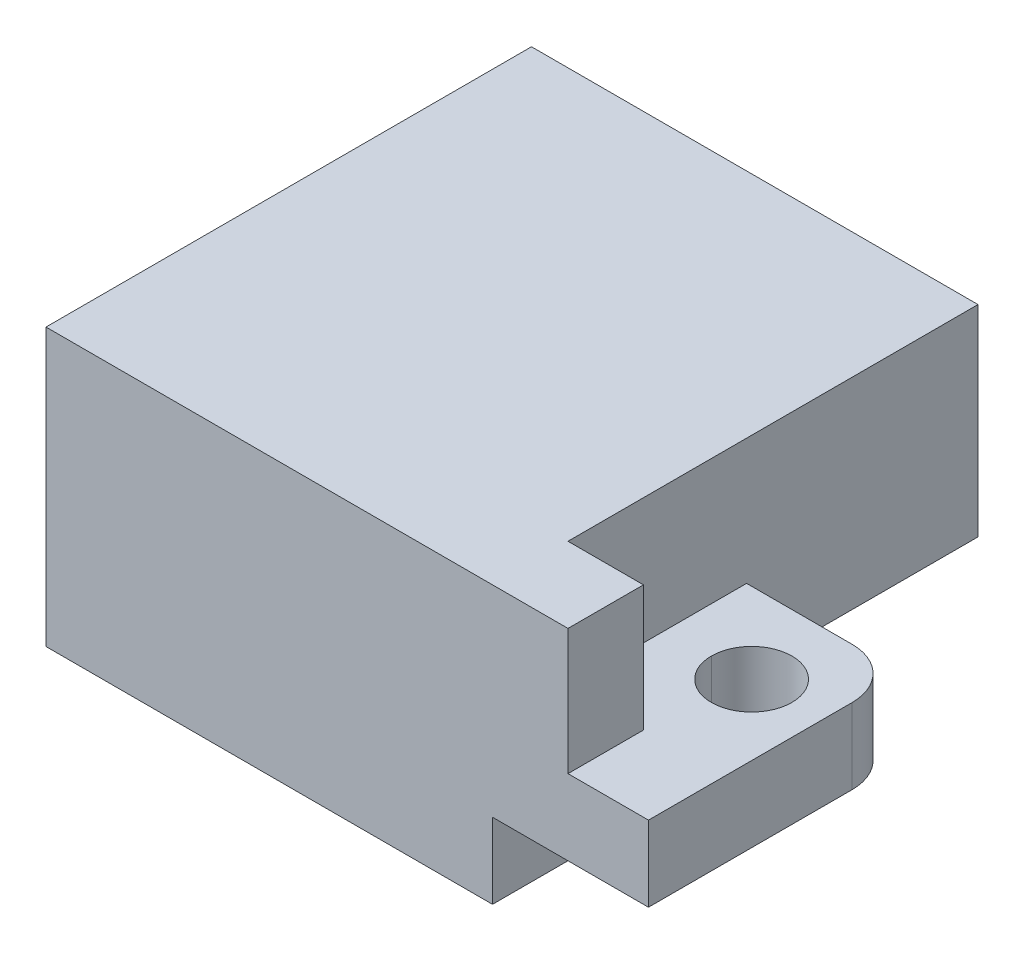
ISO-10303-21;
HEADER;
FILE_DESCRIPTION(('STEP AP214'),'2;1');
FILE_NAME('part.step','',(''),(''),'','','');
FILE_SCHEMA(('AUTOMOTIVE_DESIGN { 1 0 10303 214 1 1 1 1 }'));
ENDSEC;
DATA;
#1=APPLICATION_CONTEXT('core data for automotive mechanical design processes');
#2=APPLICATION_PROTOCOL_DEFINITION('international standard','automotive_design',2000,#1);
#3=PRODUCT_CONTEXT('',#1,'mechanical');
#4=PRODUCT('Part','Part','',(#3));
#5=PRODUCT_RELATED_PRODUCT_CATEGORY('part','',(#4));
#6=PRODUCT_DEFINITION_FORMATION('','',#4);
#7=PRODUCT_DEFINITION_CONTEXT('part definition',#1,'design');
#8=PRODUCT_DEFINITION('design','',#6,#7);
#9=PRODUCT_DEFINITION_SHAPE('','',#8);
#10=(LENGTH_UNIT() NAMED_UNIT(*) SI_UNIT(.MILLI.,.METRE.));
#11=(NAMED_UNIT(*) PLANE_ANGLE_UNIT() SI_UNIT($,.RADIAN.));
#12=(NAMED_UNIT(*) SI_UNIT($,.STERADIAN.) SOLID_ANGLE_UNIT());
#13=UNCERTAINTY_MEASURE_WITH_UNIT(LENGTH_MEASURE(1.E-05),#10,'distance_accuracy_value','');
#14=(GEOMETRIC_REPRESENTATION_CONTEXT(3) GLOBAL_UNCERTAINTY_ASSIGNED_CONTEXT((#13)) GLOBAL_UNIT_ASSIGNED_CONTEXT((#10,
#11,#12)) REPRESENTATION_CONTEXT('',''));
#15=CARTESIAN_POINT('',(0.,0.,0.));
#16=DIRECTION('',(0.,0.,1.));
#17=DIRECTION('',(1.,0.,0.));
#18=AXIS2_PLACEMENT_3D('',#15,#16,#17);
#19=CARTESIAN_POINT('',(-146.083399220501,-24.7311663924978,-18.5004782565443));
#20=DIRECTION('',(0.,-1.,0.));
#21=DIRECTION('',(1.,0.,0.));
#22=AXIS2_PLACEMENT_3D('',#19,#20,#21);
#23=PLANE('',#22);
#24=DIRECTION('',(0.,0.,1.));
#25=VECTOR('',#24,1.);
#26=CARTESIAN_POINT('',(45.1666007794988,-24.7311663924978,12.6648268804915));
#27=LINE('',#26,#25);
#28=CARTESIAN_POINT('',(45.1666007794988,-24.7311663924978,8.66482688049147));
#29=VERTEX_POINT('',#28);
#30=CARTESIAN_POINT('',(45.1666007794988,-24.7311663924978,13.6648268804915));
#31=VERTEX_POINT('',#30);
#32=EDGE_CURVE('E267',#29,#31,#27,.T.);
#33=ORIENTED_EDGE('',*,*,#32,.F.);
#34=DIRECTION('',(-1.,0.,0.));
#35=VECTOR('',#34,1.);
#36=CARTESIAN_POINT('',(45.1666007794988,-24.7311663924978,8.66482688049147));
#37=LINE('',#36,#35);
#38=CARTESIAN_POINT('',(40.1666007794988,-24.7311663924978,8.66482688049147));
#39=VERTEX_POINT('',#38);
#40=EDGE_CURVE('E263',#29,#39,#37,.T.);
#41=ORIENTED_EDGE('',*,*,#40,.T.);
#42=DIRECTION('',(0.,0.,-1.));
#43=VECTOR('',#42,1.);
#44=CARTESIAN_POINT('',(40.1666007794991,-24.7311663924978,12.6648268804915));
#45=LINE('',#44,#43);
#46=CARTESIAN_POINT('',(40.1666007794991,-24.7311663924978,-18.5004782565443));
#47=VERTEX_POINT('',#46);
#48=EDGE_CURVE('E52',#39,#47,#45,.T.);
#49=ORIENTED_EDGE('',*,*,#48,.T.);
#50=DIRECTION('',(-1.,0.,0.));
#51=VECTOR('',#50,1.);
#52=CARTESIAN_POINT('',(-67.7500658871679,-24.7311663924978,-18.5004782565443));
#53=LINE('',#52,#51);
#54=CARTESIAN_POINT('',(10.5832674461654,-24.7311663924978,-18.5004782565443));
#55=VERTEX_POINT('',#54);
#56=EDGE_CURVE('E11',#47,#55,#53,.T.);
#57=ORIENTED_EDGE('',*,*,#56,.T.);
#58=DIRECTION('',(0.,0.,1.));
#59=VECTOR('',#58,1.);
#60=CARTESIAN_POINT('',(10.5832674461654,-24.7311663924978,-37.4791839534913));
#61=LINE('',#60,#59);
#62=CARTESIAN_POINT('',(10.5832674461654,-24.7311663924978,13.6648268804915));
#63=VERTEX_POINT('',#62);
#64=EDGE_CURVE('E266',#55,#63,#61,.T.);
#65=ORIENTED_EDGE('',*,*,#64,.T.);
#66=DIRECTION('',(-1.,0.,0.));
#67=VECTOR('',#66,1.);
#68=CARTESIAN_POINT('',(45.1666007794988,-24.7311663924978,13.6648268804915));
#69=LINE('',#68,#67);
#70=EDGE_CURVE('E47',#31,#63,#69,.T.);
#71=ORIENTED_EDGE('',*,*,#70,.F.);
#72=EDGE_LOOP('',(#33,#41,#49,#57,#65,#71));
#73=FACE_BOUND('',#72,.T.);
#74=ADVANCED_FACE('F44',(#73),#23,.F.);
#75=CARTESIAN_POINT('',(47.1666007794991,-43.0644997258311,0.164826880491474));
#76=DIRECTION('',(0.,-1.,0.));
#77=DIRECTION('',(1.,0.,0.));
#78=AXIS2_PLACEMENT_3D('',#75,#76,#77);
#79=CYLINDRICAL_SURFACE('',#78,3.33333333333333);
#80=CARTESIAN_POINT('',(47.1666007794991,-38.0644997258311,0.164826880491474));
#81=DIRECTION('',(0.,-1.,0.));
#82=DIRECTION('',(0.,0.,1.));
#83=AXIS2_PLACEMENT_3D('',#80,#81,#82);
#84=CIRCLE('',#83,3.33333333333333);
#85=CARTESIAN_POINT('',(47.1666007794991,-38.0644997258311,-3.16850645284186));
#86=VERTEX_POINT('',#85);
#87=CARTESIAN_POINT('',(50.4999341128325,-38.0644997258311,0.164826880491474));
#88=VERTEX_POINT('',#87);
#89=EDGE_CURVE('E206',#86,#88,#84,.T.);
#90=ORIENTED_EDGE('',*,*,#89,.F.);
#91=DIRECTION('',(0.,-1.,0.));
#92=VECTOR('',#91,1.);
#93=CARTESIAN_POINT('',(47.1666007794991,-38.0644997258311,-3.16850645284186));
#94=LINE('',#93,#92);
#95=CARTESIAN_POINT('',(47.1666007794991,-33.0644997258311,-3.16850645284186));
#96=VERTEX_POINT('',#95);
#97=EDGE_CURVE('E183',#96,#86,#94,.T.);
#98=ORIENTED_EDGE('',*,*,#97,.F.);
#99=CARTESIAN_POINT('',(47.1666007794991,-33.0644997258311,0.164826880491474));
#100=DIRECTION('',(0.,1.,0.));
#101=DIRECTION('',(-1.,0.,0.));
#102=AXIS2_PLACEMENT_3D('',#99,#100,#101);
#103=CIRCLE('',#102,3.33333333333333);
#104=CARTESIAN_POINT('',(50.4999341128325,-33.0644997258311,0.164826880491474));
#105=VERTEX_POINT('',#104);
#106=EDGE_CURVE('E186',#105,#96,#103,.T.);
#107=ORIENTED_EDGE('',*,*,#106,.F.);
#108=DIRECTION('',(0.,1.,0.));
#109=VECTOR('',#108,1.);
#110=CARTESIAN_POINT('',(50.4999341128325,-33.0644997258311,0.164826880491474));
#111=LINE('',#110,#109);
#112=EDGE_CURVE('E171',#88,#105,#111,.T.);
#113=ORIENTED_EDGE('',*,*,#112,.F.);
#114=EDGE_LOOP('',(#90,#98,#107,#113));
#115=FACE_BOUND('',#114,.T.);
#116=ADVANCED_FACE('F187',(#115),#79,.T.);
#117=CARTESIAN_POINT('',(45.8332674461658,-43.0644997258311,2.16482688049147));
#118=DIRECTION('',(0.,1.,0.));
#119=DIRECTION('',(-1.,0.,0.));
#120=AXIS2_PLACEMENT_3D('',#117,#118,#119);
#121=CYLINDRICAL_SURFACE('',#120,2.66666666666667);
#122=CARTESIAN_POINT('',(45.8332674461658,-38.0644997258311,2.16482688049147));
#123=DIRECTION('',(0.,1.,0.));
#124=DIRECTION('',(0.,0.,1.));
#125=AXIS2_PLACEMENT_3D('',#122,#123,#124);
#126=CIRCLE('',#125,2.66666666666667);
#127=CARTESIAN_POINT('',(48.4999341128325,-38.0644997258311,2.16482688049147));
#128=VERTEX_POINT('',#127);
#129=CARTESIAN_POINT('',(43.1666007794991,-38.0644997258311,2.16482688049147));
#130=VERTEX_POINT('',#129);
#131=EDGE_CURVE('E228',#128,#130,#126,.T.);
#132=ORIENTED_EDGE('',*,*,#131,.F.);
#133=DIRECTION('',(0.,1.,0.));
#134=VECTOR('',#133,1.);
#135=CARTESIAN_POINT('',(48.4999341128325,-43.0644997258311,2.16482688049147));
#136=LINE('',#135,#134);
#137=CARTESIAN_POINT('',(48.4999341128325,-33.0644997258311,2.16482688049147));
#138=VERTEX_POINT('',#137);
#139=EDGE_CURVE('E223',#128,#138,#136,.T.);
#140=ORIENTED_EDGE('',*,*,#139,.T.);
#141=CARTESIAN_POINT('',(45.8332674461658,-33.0644997258311,2.16482688049147));
#142=DIRECTION('',(0.,1.,0.));
#143=DIRECTION('',(-1.,0.,0.));
#144=AXIS2_PLACEMENT_3D('',#141,#142,#143);
#145=CIRCLE('',#144,2.66666666666667);
#146=CARTESIAN_POINT('',(43.1666007794991,-33.0644997258311,2.16482688049147));
#147=VERTEX_POINT('',#146);
#148=EDGE_CURVE('E227',#138,#147,#145,.T.);
#149=ORIENTED_EDGE('',*,*,#148,.T.);
#150=DIRECTION('',(0.,1.,0.));
#151=VECTOR('',#150,1.);
#152=CARTESIAN_POINT('',(43.1666007794991,-43.0644997258311,2.16482688049147));
#153=LINE('',#152,#151);
#154=EDGE_CURVE('E291',#130,#147,#153,.T.);
#155=ORIENTED_EDGE('',*,*,#154,.F.);
#156=EDGE_LOOP('',(#132,#140,#149,#155));
#157=FACE_BOUND('',#156,.T.);
#158=ADVANCED_FACE('F318',(#157),#121,.F.);
#159=CARTESIAN_POINT('',(45.8332674461658,-43.0644997258311,2.16482688049147));
#160=DIRECTION('',(0.,1.,0.));
#161=DIRECTION('',(-1.,0.,0.));
#162=AXIS2_PLACEMENT_3D('',#159,#160,#161);
#163=CYLINDRICAL_SURFACE('',#162,2.66666666666667);
#164=ORIENTED_EDGE('',*,*,#139,.F.);
#165=CARTESIAN_POINT('',(45.8332674461658,-38.0644997258311,2.16482688049147));
#166=DIRECTION('',(0.,1.,0.));
#167=DIRECTION('',(0.,0.,1.));
#168=AXIS2_PLACEMENT_3D('',#165,#166,#167);
#169=CIRCLE('',#168,2.66666666666667);
#170=EDGE_CURVE('E198',#130,#128,#169,.T.);
#171=ORIENTED_EDGE('',*,*,#170,.F.);
#172=ORIENTED_EDGE('',*,*,#154,.T.);
#173=CARTESIAN_POINT('',(45.8332674461658,-33.0644997258311,2.16482688049147));
#174=DIRECTION('',(0.,1.,0.));
#175=DIRECTION('',(-1.,0.,0.));
#176=AXIS2_PLACEMENT_3D('',#173,#174,#175);
#177=CIRCLE('',#176,2.66666666666667);
#178=EDGE_CURVE('E216',#147,#138,#177,.T.);
#179=ORIENTED_EDGE('',*,*,#178,.T.);
#180=EDGE_LOOP('',(#164,#171,#172,#179));
#181=FACE_BOUND('',#180,.T.);
#182=ADVANCED_FACE('F399',(#181),#163,.F.);
#183=CARTESIAN_POINT('',(50.4999341128325,-43.0644997258311,4.33149354715814));
#184=DIRECTION('',(1.,0.,0.));
#185=DIRECTION('',(0.,1.,0.));
#186=AXIS2_PLACEMENT_3D('',#183,#184,#185);
#187=PLANE('',#186);
#188=DIRECTION('',(0.,0.,-1.));
#189=VECTOR('',#188,1.);
#190=CARTESIAN_POINT('',(50.4999341128325,-38.0644997258311,4.33149354715814));
#191=LINE('',#190,#189);
#192=CARTESIAN_POINT('',(50.4999341128325,-38.0644997258311,13.6648268804915));
#193=VERTEX_POINT('',#192);
#194=EDGE_CURVE('E177',#193,#88,#191,.T.);
#195=ORIENTED_EDGE('',*,*,#194,.T.);
#196=ORIENTED_EDGE('',*,*,#112,.T.);
#197=DIRECTION('',(0.,0.,-1.));
#198=VECTOR('',#197,1.);
#199=CARTESIAN_POINT('',(50.4999341128325,-33.0644997258311,4.33149354715814));
#200=LINE('',#199,#198);
#201=CARTESIAN_POINT('',(50.4999341128325,-33.0644997258311,13.6648268804915));
#202=VERTEX_POINT('',#201);
#203=EDGE_CURVE('E175',#202,#105,#200,.T.);
#204=ORIENTED_EDGE('',*,*,#203,.F.);
#205=DIRECTION('',(0.,1.,0.));
#206=VECTOR('',#205,1.);
#207=CARTESIAN_POINT('',(50.4999341128325,-33.0644997258311,13.6648268804915));
#208=LINE('',#207,#206);
#209=EDGE_CURVE('E182',#193,#202,#208,.T.);
#210=ORIENTED_EDGE('',*,*,#209,.F.);
#211=EDGE_LOOP('',(#195,#196,#204,#210));
#212=FACE_BOUND('',#211,.T.);
#213=ADVANCED_FACE('F173',(#212),#187,.T.);
#214=CARTESIAN_POINT('',(40.1666007794991,-43.0644997258311,12.6648268804915));
#215=DIRECTION('',(1.,0.,0.));
#216=DIRECTION('',(0.,1.,0.));
#217=AXIS2_PLACEMENT_3D('',#214,#215,#216);
#218=PLANE('',#217);
#219=DIRECTION('',(0.,-1.,0.));
#220=VECTOR('',#219,1.);
#221=CARTESIAN_POINT('',(40.1666007794988,-43.0644997258311,8.66482688049147));
#222=LINE('',#221,#220);
#223=CARTESIAN_POINT('',(40.1666007794988,-38.0644997258311,8.66482688049147));
#224=VERTEX_POINT('',#223);
#225=CARTESIAN_POINT('',(40.1666007794988,-43.0644997258311,8.66482688049147));
#226=VERTEX_POINT('',#225);
#227=EDGE_CURVE('E301',#224,#226,#222,.T.);
#228=ORIENTED_EDGE('',*,*,#227,.F.);
#229=DIRECTION('',(0.,0.,-1.));
#230=VECTOR('',#229,1.);
#231=CARTESIAN_POINT('',(40.1666007794991,-38.0644997258311,4.33149354715814));
#232=LINE('',#231,#230);
#233=CARTESIAN_POINT('',(40.1666007794988,-38.0644997258311,13.6648268804915));
#234=VERTEX_POINT('',#233);
#235=EDGE_CURVE('E304',#234,#224,#232,.T.);
#236=ORIENTED_EDGE('',*,*,#235,.F.);
#237=DIRECTION('',(0.,1.,0.));
#238=VECTOR('',#237,1.);
#239=CARTESIAN_POINT('',(40.1666007794988,-38.0644997258311,13.6648268804915));
#240=LINE('',#239,#238);
#241=CARTESIAN_POINT('',(40.1666007794988,-43.0644997258311,13.6648268804915));
#242=VERTEX_POINT('',#241);
#243=EDGE_CURVE('E260',#242,#234,#240,.T.);
#244=ORIENTED_EDGE('',*,*,#243,.F.);
#245=DIRECTION('',(0.,0.,-1.));
#246=VECTOR('',#245,1.);
#247=CARTESIAN_POINT('',(40.1666007794988,-43.0644997258311,12.6648268804915));
#248=LINE('',#247,#246);
#249=EDGE_CURVE('E255',#242,#226,#248,.T.);
#250=ORIENTED_EDGE('',*,*,#249,.T.);
#251=EDGE_LOOP('',(#228,#236,#244,#250));
#252=FACE_BOUND('',#251,.T.);
#253=ADVANCED_FACE('F389',(#252),#218,.T.);
#254=CARTESIAN_POINT('',(45.1666007794988,-43.0644997258311,12.6648268804915));
#255=DIRECTION('',(0.,-1.,0.));
#256=DIRECTION('',(0.,0.,-1.));
#257=AXIS2_PLACEMENT_3D('',#254,#255,#256);
#258=PLANE('',#257);
#259=DIRECTION('',(1.,0.,0.));
#260=VECTOR('',#259,1.);
#261=CARTESIAN_POINT('',(40.1666007794988,-43.0644997258311,13.6648268804915));
#262=LINE('',#261,#260);
#263=CARTESIAN_POINT('',(10.5832674461654,-43.0644997258311,13.6648268804915));
#264=VERTEX_POINT('',#263);
#265=EDGE_CURVE('E288',#264,#242,#262,.T.);
#266=ORIENTED_EDGE('',*,*,#265,.F.);
#267=DIRECTION('',(0.,0.,-1.));
#268=VECTOR('',#267,1.);
#269=CARTESIAN_POINT('',(10.5832674461654,-43.0644997258312,12.6648268804915));
#270=LINE('',#269,#268);
#271=CARTESIAN_POINT('',(10.5832674461654,-43.0644997258311,8.66482688049147));
#272=VERTEX_POINT('',#271);
#273=EDGE_CURVE('E376',#264,#272,#270,.T.);
#274=ORIENTED_EDGE('',*,*,#273,.T.);
#275=DIRECTION('',(-1.,0.,0.));
#276=VECTOR('',#275,1.);
#277=CARTESIAN_POINT('',(40.1666007794988,-43.0644997258311,8.66482688049147));
#278=LINE('',#277,#276);
#279=EDGE_CURVE('E284',#226,#272,#278,.T.);
#280=ORIENTED_EDGE('',*,*,#279,.F.);
#281=ORIENTED_EDGE('',*,*,#249,.F.);
#282=EDGE_LOOP('',(#266,#274,#280,#281));
#283=FACE_BOUND('',#282,.T.);
#284=ADVANCED_FACE('F379',(#283),#258,.T.);
#285=CARTESIAN_POINT('',(45.1666007794988,-43.0644997258311,8.66482688049147));
#286=DIRECTION('',(0.,0.,1.));
#287=DIRECTION('',(1.,0.,0.));
#288=AXIS2_PLACEMENT_3D('',#285,#286,#287);
#289=PLANE('',#288);
#290=DIRECTION('',(0.,-1.,0.));
#291=VECTOR('',#290,1.);
#292=CARTESIAN_POINT('',(10.5832674461654,-43.0644997258311,8.66482688049147));
#293=LINE('',#292,#291);
#294=CARTESIAN_POINT('',(10.5832674461654,-38.0644997258311,8.66482688049147));
#295=VERTEX_POINT('',#294);
#296=EDGE_CURVE('E372',#295,#272,#293,.T.);
#297=ORIENTED_EDGE('',*,*,#296,.F.);
#298=DIRECTION('',(1.,0.,0.));
#299=VECTOR('',#298,1.);
#300=CARTESIAN_POINT('',(40.1666007794988,-38.0644997258311,8.66482688049147));
#301=LINE('',#300,#299);
#302=EDGE_CURVE('E202',#295,#224,#301,.T.);
#303=ORIENTED_EDGE('',*,*,#302,.T.);
#304=ORIENTED_EDGE('',*,*,#227,.T.);
#305=ORIENTED_EDGE('',*,*,#279,.T.);
#306=EDGE_LOOP('',(#297,#303,#304,#305));
#307=FACE_BOUND('',#306,.T.);
#308=ADVANCED_FACE('F385',(#307),#289,.F.);
#309=CARTESIAN_POINT('',(45.1666007794988,-43.0644997258311,13.6648268804915));
#310=DIRECTION('',(0.,0.,-1.));
#311=DIRECTION('',(0.,-1.,0.));
#312=AXIS2_PLACEMENT_3D('',#309,#310,#311);
#313=PLANE('',#312);
#314=DIRECTION('',(0.,1.,0.));
#315=VECTOR('',#314,1.);
#316=CARTESIAN_POINT('',(45.1666007794988,176.935500274169,13.6648268804915));
#317=LINE('',#316,#315);
#318=CARTESIAN_POINT('',(45.1666007794988,-33.0644997258311,13.6648268804915));
#319=VERTEX_POINT('',#318);
#320=EDGE_CURVE('E249',#319,#31,#317,.T.);
#321=ORIENTED_EDGE('',*,*,#320,.T.);
#322=ORIENTED_EDGE('',*,*,#70,.T.);
#323=DIRECTION('',(0.,1.,0.));
#324=VECTOR('',#323,1.);
#325=CARTESIAN_POINT('',(10.5832674461654,-43.0644997258311,13.6648268804915));
#326=LINE('',#325,#324);
#327=EDGE_CURVE('E275',#264,#63,#326,.T.);
#328=ORIENTED_EDGE('',*,*,#327,.F.);
#329=ORIENTED_EDGE('',*,*,#265,.T.);
#330=ORIENTED_EDGE('',*,*,#243,.T.);
#331=DIRECTION('',(1.,0.,0.));
#332=VECTOR('',#331,1.);
#333=CARTESIAN_POINT('',(50.4999341128325,-38.0644997258311,13.6648268804915));
#334=LINE('',#333,#332);
#335=EDGE_CURVE('E208',#234,#193,#334,.T.);
#336=ORIENTED_EDGE('',*,*,#335,.T.);
#337=ORIENTED_EDGE('',*,*,#209,.T.);
#338=DIRECTION('',(-1.,0.,0.));
#339=VECTOR('',#338,1.);
#340=CARTESIAN_POINT('',(45.1666007794988,-33.0644997258311,13.6648268804915));
#341=LINE('',#340,#339);
#342=EDGE_CURVE('E196',#202,#319,#341,.T.);
#343=ORIENTED_EDGE('',*,*,#342,.T.);
#344=EDGE_LOOP('',(#321,#322,#328,#329,#330,#336,#337,#343));
#345=FACE_BOUND('',#344,.T.);
#346=ADVANCED_FACE('F274',(#345),#313,.F.);
#347=CARTESIAN_POINT('',(50.4999341128325,-43.0644997258311,-3.16850645284186));
#348=DIRECTION('',(0.,0.,1.));
#349=DIRECTION('',(1.,0.,0.));
#350=AXIS2_PLACEMENT_3D('',#347,#348,#349);
#351=PLANE('',#350);
#352=DIRECTION('',(-1.,0.,0.));
#353=VECTOR('',#352,1.);
#354=CARTESIAN_POINT('',(50.4999341128325,-33.0644997258311,-3.16850645284186));
#355=LINE('',#354,#353);
#356=CARTESIAN_POINT('',(40.1666007794991,-33.0644997258311,-3.16850645284186));
#357=VERTEX_POINT('',#356);
#358=EDGE_CURVE('E191',#96,#357,#355,.T.);
#359=ORIENTED_EDGE('',*,*,#358,.F.);
#360=ORIENTED_EDGE('',*,*,#97,.T.);
#361=DIRECTION('',(-1.,0.,0.));
#362=VECTOR('',#361,1.);
#363=CARTESIAN_POINT('',(50.4999341128325,-38.0644997258311,-3.16850645284186));
#364=LINE('',#363,#362);
#365=CARTESIAN_POINT('',(40.1666007794991,-38.0644997258311,-3.16850645284186));
#366=VERTEX_POINT('',#365);
#367=EDGE_CURVE('E229',#86,#366,#364,.T.);
#368=ORIENTED_EDGE('',*,*,#367,.T.);
#369=DIRECTION('',(0.,1.,0.));
#370=VECTOR('',#369,1.);
#371=CARTESIAN_POINT('',(40.1666007794991,-43.0644997258311,-3.16850645284186));
#372=LINE('',#371,#370);
#373=EDGE_CURVE('E254',#366,#357,#372,.T.);
#374=ORIENTED_EDGE('',*,*,#373,.T.);
#375=EDGE_LOOP('',(#359,#360,#368,#374));
#376=FACE_BOUND('',#375,.T.);
#377=ADVANCED_FACE('F358',(#376),#351,.F.);
#378=CARTESIAN_POINT('',(50.4999341128325,-33.0644997258311,4.33149354715814));
#379=DIRECTION('',(0.,1.,0.));
#380=DIRECTION('',(1.,0.,0.));
#381=AXIS2_PLACEMENT_3D('',#378,#379,#380);
#382=PLANE('',#381);
#383=ORIENTED_EDGE('',*,*,#178,.F.);
#384=ORIENTED_EDGE('',*,*,#148,.F.);
#385=EDGE_LOOP('',(#383,#384));
#386=FACE_BOUND('',#385,.T.);
#387=ORIENTED_EDGE('',*,*,#203,.T.);
#388=ORIENTED_EDGE('',*,*,#106,.T.);
#389=ORIENTED_EDGE('',*,*,#358,.T.);
#390=DIRECTION('',(0.,0.,-1.));
#391=VECTOR('',#390,1.);
#392=CARTESIAN_POINT('',(40.1666007794991,-33.0644997258311,4.33149354715814));
#393=LINE('',#392,#391);
#394=CARTESIAN_POINT('',(40.1666007794988,-33.0644997258311,8.66482688049147));
#395=VERTEX_POINT('',#394);
#396=EDGE_CURVE('E250',#395,#357,#393,.T.);
#397=ORIENTED_EDGE('',*,*,#396,.F.);
#398=DIRECTION('',(1.,0.,0.));
#399=VECTOR('',#398,1.);
#400=CARTESIAN_POINT('',(45.1666007794988,-33.0644997258311,8.66482688049147));
#401=LINE('',#400,#399);
#402=CARTESIAN_POINT('',(45.1666007794988,-33.0644997258311,8.66482688049147));
#403=VERTEX_POINT('',#402);
#404=EDGE_CURVE('E232',#395,#403,#401,.T.);
#405=ORIENTED_EDGE('',*,*,#404,.T.);
#406=DIRECTION('',(0.,0.,-1.));
#407=VECTOR('',#406,1.);
#408=CARTESIAN_POINT('',(45.1666007794988,-33.0644997258311,12.6648268804915));
#409=LINE('',#408,#407);
#410=EDGE_CURVE('E244',#319,#403,#409,.T.);
#411=ORIENTED_EDGE('',*,*,#410,.F.);
#412=ORIENTED_EDGE('',*,*,#342,.F.);
#413=EDGE_LOOP('',(#387,#388,#389,#397,#405,#411,#412));
#414=FACE_BOUND('',#413,.T.);
#415=ADVANCED_FACE('F194',(#386,#414),#382,.T.);
#416=CARTESIAN_POINT('',(45.1666007794988,-43.0644997258311,8.66482688049147));
#417=DIRECTION('',(0.,0.,-1.));
#418=DIRECTION('',(0.,-1.,0.));
#419=AXIS2_PLACEMENT_3D('',#416,#417,#418);
#420=PLANE('',#419);
#421=ORIENTED_EDGE('',*,*,#40,.F.);
#422=DIRECTION('',(0.,-1.,0.));
#423=VECTOR('',#422,1.);
#424=CARTESIAN_POINT('',(45.1666007794988,176.935500274169,8.66482688049147));
#425=LINE('',#424,#423);
#426=EDGE_CURVE('E248',#29,#403,#425,.T.);
#427=ORIENTED_EDGE('',*,*,#426,.T.);
#428=ORIENTED_EDGE('',*,*,#404,.F.);
#429=DIRECTION('',(0.,1.,0.));
#430=VECTOR('',#429,1.);
#431=CARTESIAN_POINT('',(40.1666007794988,176.935500274169,8.66482688049147));
#432=LINE('',#431,#430);
#433=EDGE_CURVE('E221',#395,#39,#432,.T.);
#434=ORIENTED_EDGE('',*,*,#433,.T.);
#435=EDGE_LOOP('',(#421,#427,#428,#434));
#436=FACE_BOUND('',#435,.T.);
#437=ADVANCED_FACE('F363',(#436),#420,.T.);
#438=CARTESIAN_POINT('',(10.5832674461654,120.268833607502,-37.4791839534913));
#439=DIRECTION('',(-1.,0.,0.));
#440=DIRECTION('',(0.,-1.,0.));
#441=AXIS2_PLACEMENT_3D('',#438,#439,#440);
#442=PLANE('',#441);
#443=ORIENTED_EDGE('',*,*,#64,.F.);
#444=DIRECTION('',(0.,1.,0.));
#445=VECTOR('',#444,1.);
#446=CARTESIAN_POINT('',(10.5832674461654,-43.0644997258313,-18.5004782565443));
#447=LINE('',#446,#445);
#448=CARTESIAN_POINT('',(10.5832674461654,-38.0644997258312,-18.5004782565443));
#449=VERTEX_POINT('',#448);
#450=EDGE_CURVE('E241',#449,#55,#447,.T.);
#451=ORIENTED_EDGE('',*,*,#450,.F.);
#452=DIRECTION('',(0.,0.,1.));
#453=VECTOR('',#452,1.);
#454=CARTESIAN_POINT('',(10.5832674461654,-38.0644997258311,8.66482688049147));
#455=LINE('',#454,#453);
#456=EDGE_CURVE('E269',#449,#295,#455,.T.);
#457=ORIENTED_EDGE('',*,*,#456,.T.);
#458=ORIENTED_EDGE('',*,*,#296,.T.);
#459=ORIENTED_EDGE('',*,*,#273,.F.);
#460=ORIENTED_EDGE('',*,*,#327,.T.);
#461=EDGE_LOOP('',(#443,#451,#457,#458,#459,#460));
#462=FACE_BOUND('',#461,.T.);
#463=ADVANCED_FACE('F383',(#462),#442,.T.);
#464=CARTESIAN_POINT('',(40.1666007794988,-38.0644997258311,8.66482688049147));
#465=DIRECTION('',(0.,1.,0.));
#466=DIRECTION('',(1.,0.,0.));
#467=AXIS2_PLACEMENT_3D('',#464,#465,#466);
#468=PLANE('',#467);
#469=ORIENTED_EDGE('',*,*,#170,.T.);
#470=ORIENTED_EDGE('',*,*,#131,.T.);
#471=EDGE_LOOP('',(#469,#470));
#472=FACE_BOUND('',#471,.T.);
#473=ORIENTED_EDGE('',*,*,#456,.F.);
#474=DIRECTION('',(1.,0.,0.));
#475=VECTOR('',#474,1.);
#476=CARTESIAN_POINT('',(-67.7500658871679,-38.0644997258313,-18.5004782565443));
#477=LINE('',#476,#475);
#478=CARTESIAN_POINT('',(40.1666007794991,-38.0644997258311,-18.5004782565443));
#479=VERTEX_POINT('',#478);
#480=EDGE_CURVE('E236',#449,#479,#477,.T.);
#481=ORIENTED_EDGE('',*,*,#480,.T.);
#482=DIRECTION('',(0.,0.,-1.));
#483=VECTOR('',#482,1.);
#484=CARTESIAN_POINT('',(40.1666007794988,-38.0644997258311,8.66482688049147));
#485=LINE('',#484,#483);
#486=EDGE_CURVE('E222',#366,#479,#485,.T.);
#487=ORIENTED_EDGE('',*,*,#486,.F.);
#488=ORIENTED_EDGE('',*,*,#367,.F.);
#489=ORIENTED_EDGE('',*,*,#89,.T.);
#490=ORIENTED_EDGE('',*,*,#194,.F.);
#491=ORIENTED_EDGE('',*,*,#335,.F.);
#492=ORIENTED_EDGE('',*,*,#235,.T.);
#493=ORIENTED_EDGE('',*,*,#302,.F.);
#494=EDGE_LOOP('',(#473,#481,#487,#488,#489,#490,#491,#492,#493));
#495=FACE_BOUND('',#494,.T.);
#496=ADVANCED_FACE('F313',(#472,#495),#468,.F.);
#497=CARTESIAN_POINT('',(40.1666007794991,-43.0644997258311,12.6648268804915));
#498=DIRECTION('',(1.,0.,0.));
#499=DIRECTION('',(0.,1.,0.));
#500=AXIS2_PLACEMENT_3D('',#497,#498,#499);
#501=PLANE('',#500);
#502=ORIENTED_EDGE('',*,*,#48,.F.);
#503=ORIENTED_EDGE('',*,*,#433,.F.);
#504=ORIENTED_EDGE('',*,*,#396,.T.);
#505=ORIENTED_EDGE('',*,*,#373,.F.);
#506=ORIENTED_EDGE('',*,*,#486,.T.);
#507=DIRECTION('',(0.,1.,0.));
#508=VECTOR('',#507,1.);
#509=CARTESIAN_POINT('',(40.1666007794991,-43.0644997258311,-18.5004782565443));
#510=LINE('',#509,#508);
#511=EDGE_CURVE('E217',#479,#47,#510,.T.);
#512=ORIENTED_EDGE('',*,*,#511,.T.);
#513=EDGE_LOOP('',(#502,#503,#504,#505,#506,#512));
#514=FACE_BOUND('',#513,.T.);
#515=ADVANCED_FACE('F362',(#514),#501,.T.);
#516=CARTESIAN_POINT('',(-67.7500658871679,-43.0644997258313,-18.5004782565443));
#517=DIRECTION('',(0.,0.,-1.));
#518=DIRECTION('',(0.,-1.,0.));
#519=AXIS2_PLACEMENT_3D('',#516,#517,#518);
#520=PLANE('',#519);
#521=ORIENTED_EDGE('',*,*,#56,.F.);
#522=ORIENTED_EDGE('',*,*,#511,.F.);
#523=ORIENTED_EDGE('',*,*,#480,.F.);
#524=ORIENTED_EDGE('',*,*,#450,.T.);
#525=EDGE_LOOP('',(#521,#522,#523,#524));
#526=FACE_BOUND('',#525,.T.);
#527=ADVANCED_FACE('F365',(#526),#520,.T.);
#528=CARTESIAN_POINT('',(45.1666007794988,-43.0644997258311,12.6648268804915));
#529=DIRECTION('',(-1.,0.,0.));
#530=DIRECTION('',(0.,0.,1.));
#531=AXIS2_PLACEMENT_3D('',#528,#529,#530);
#532=PLANE('',#531);
#533=ORIENTED_EDGE('',*,*,#426,.F.);
#534=ORIENTED_EDGE('',*,*,#32,.T.);
#535=ORIENTED_EDGE('',*,*,#320,.F.);
#536=ORIENTED_EDGE('',*,*,#410,.T.);
#537=EDGE_LOOP('',(#533,#534,#535,#536));
#538=FACE_BOUND('',#537,.T.);
#539=ADVANCED_FACE('F281',(#538),#532,.F.);
#540=CLOSED_SHELL('',(#74,#116,#158,#182,#213,#253,#284,#308,#346,#377,#415,#437,#463,#496,#515,
#527,#539));
#541=MANIFOLD_SOLID_BREP('B2',#540);
#542=ADVANCED_BREP_SHAPE_REPRESENTATION('',(#18,#541),#14);
#543=SHAPE_DEFINITION_REPRESENTATION(#9,#542);
ENDSEC;
END-ISO-10303-21;
